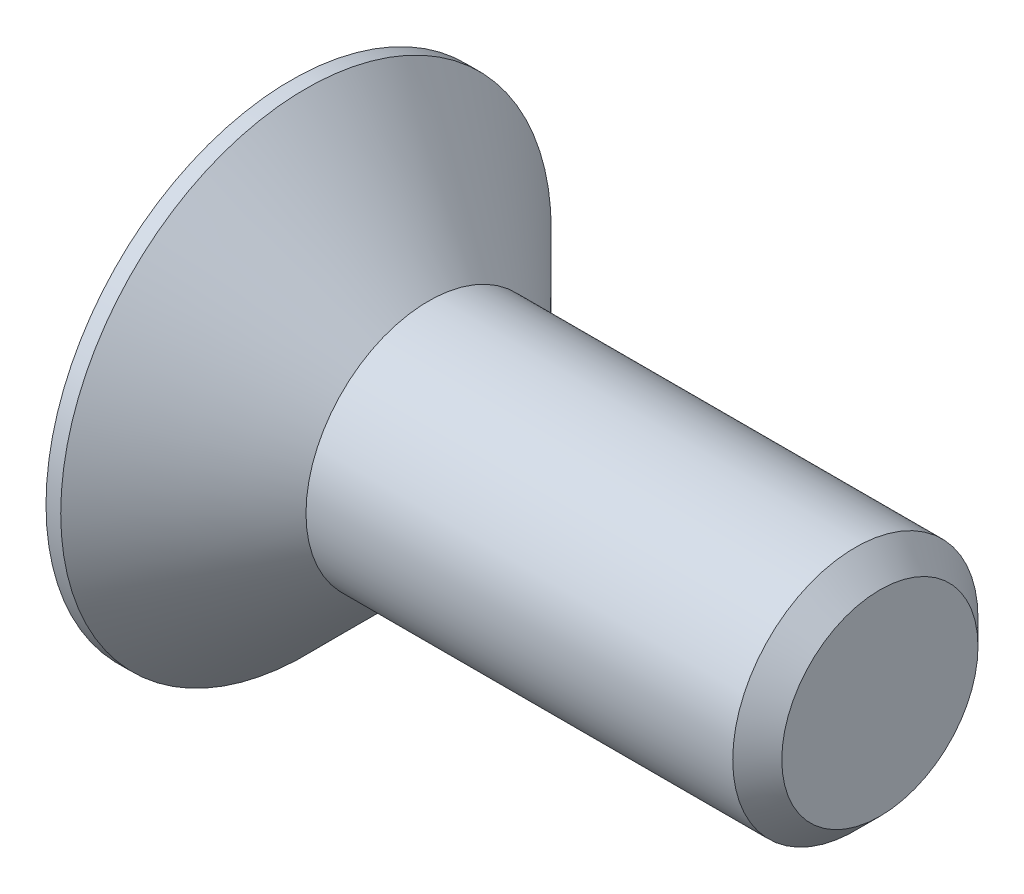
ISO-10303-21;
HEADER;
FILE_DESCRIPTION(('STEP AP214'),'2;1');
FILE_NAME('part.step','',(''),(''),'','','');
FILE_SCHEMA(('AUTOMOTIVE_DESIGN { 1 0 10303 214 1 1 1 1 }'));
ENDSEC;
DATA;
#1=APPLICATION_CONTEXT('core data for automotive mechanical design processes');
#2=APPLICATION_PROTOCOL_DEFINITION('international standard','automotive_design',2000,#1);
#3=PRODUCT_CONTEXT('',#1,'mechanical');
#4=PRODUCT('Part','Part','',(#3));
#5=PRODUCT_RELATED_PRODUCT_CATEGORY('part','',(#4));
#6=PRODUCT_DEFINITION_FORMATION('','',#4);
#7=PRODUCT_DEFINITION_CONTEXT('part definition',#1,'design');
#8=PRODUCT_DEFINITION('design','',#6,#7);
#9=PRODUCT_DEFINITION_SHAPE('','',#8);
#10=(LENGTH_UNIT() NAMED_UNIT(*) SI_UNIT(.MILLI.,.METRE.));
#11=(NAMED_UNIT(*) PLANE_ANGLE_UNIT() SI_UNIT($,.RADIAN.));
#12=(NAMED_UNIT(*) SI_UNIT($,.STERADIAN.) SOLID_ANGLE_UNIT());
#13=UNCERTAINTY_MEASURE_WITH_UNIT(LENGTH_MEASURE(1.E-05),#10,'distance_accuracy_value','');
#14=(GEOMETRIC_REPRESENTATION_CONTEXT(3) GLOBAL_UNCERTAINTY_ASSIGNED_CONTEXT((#13)) GLOBAL_UNIT_ASSIGNED_CONTEXT((#10,
#11,#12)) REPRESENTATION_CONTEXT('',''));
#15=CARTESIAN_POINT('',(0.,0.,0.));
#16=DIRECTION('',(0.,0.,1.));
#17=DIRECTION('',(1.,0.,0.));
#18=AXIS2_PLACEMENT_3D('',#15,#16,#17);
#19=CARTESIAN_POINT('',(0.,0.,0.));
#20=DIRECTION('',(1.,0.,0.));
#21=DIRECTION('',(0.,0.,-1.));
#22=AXIS2_PLACEMENT_3D('',#19,#20,#21);
#23=PLANE('',#22);
#24=DIRECTION('',(0.,0.866025403784439,0.5));
#25=VECTOR('',#24,1.);
#26=CARTESIAN_POINT('',(0.,-0.75,0.433012701892219));
#27=LINE('',#26,#25);
#28=CARTESIAN_POINT('',(0.,-0.75,0.433012701892219));
#29=VERTEX_POINT('',#28);
#30=CARTESIAN_POINT('',(0.,0.,0.866025403784438));
#31=VERTEX_POINT('',#30);
#32=EDGE_CURVE('E122',#29,#31,#27,.T.);
#33=ORIENTED_EDGE('',*,*,#32,.F.);
#34=DIRECTION('',(0.,0.,1.));
#35=VECTOR('',#34,1.);
#36=CARTESIAN_POINT('',(0.,-0.75,-0.43301270189222));
#37=LINE('',#36,#35);
#38=CARTESIAN_POINT('',(0.,-0.75,-0.43301270189222));
#39=VERTEX_POINT('',#38);
#40=EDGE_CURVE('E48',#39,#29,#37,.T.);
#41=ORIENTED_EDGE('',*,*,#40,.F.);
#42=DIRECTION('',(0.,-0.866025403784439,0.5));
#43=VECTOR('',#42,1.);
#44=CARTESIAN_POINT('',(0.,0.,-0.866025403784439));
#45=LINE('',#44,#43);
#46=CARTESIAN_POINT('',(0.,0.,-0.866025403784439));
#47=VERTEX_POINT('',#46);
#48=EDGE_CURVE('E131',#47,#39,#45,.T.);
#49=ORIENTED_EDGE('',*,*,#48,.F.);
#50=DIRECTION('',(0.,-0.866025403784439,-0.5));
#51=VECTOR('',#50,1.);
#52=CARTESIAN_POINT('',(0.,0.75,-0.43301270189222));
#53=LINE('',#52,#51);
#54=CARTESIAN_POINT('',(0.,0.75,-0.43301270189222));
#55=VERTEX_POINT('',#54);
#56=EDGE_CURVE('E129',#55,#47,#53,.T.);
#57=ORIENTED_EDGE('',*,*,#56,.F.);
#58=DIRECTION('',(0.,0.,-1.));
#59=VECTOR('',#58,1.);
#60=CARTESIAN_POINT('',(0.,0.75,0.433012701892219));
#61=LINE('',#60,#59);
#62=CARTESIAN_POINT('',(0.,0.75,0.433012701892219));
#63=VERTEX_POINT('',#62);
#64=EDGE_CURVE('E96',#63,#55,#61,.T.);
#65=ORIENTED_EDGE('',*,*,#64,.F.);
#66=DIRECTION('',(0.,0.866025403784439,-0.5));
#67=VECTOR('',#66,1.);
#68=CARTESIAN_POINT('',(0.,0.,0.866025403784438));
#69=LINE('',#68,#67);
#70=EDGE_CURVE('E125',#31,#63,#69,.T.);
#71=ORIENTED_EDGE('',*,*,#70,.F.);
#72=EDGE_LOOP('',(#33,#41,#49,#57,#65,#71));
#73=FACE_BOUND('',#72,.T.);
#74=CARTESIAN_POINT('',(0.,0.,0.));
#75=DIRECTION('',(-1.,0.,0.));
#76=DIRECTION('',(0.,0.,1.));
#77=AXIS2_PLACEMENT_3D('',#74,#75,#76);
#78=CIRCLE('',#77,2.5);
#79=CARTESIAN_POINT('',(0.,0.,2.5));
#80=VERTEX_POINT('',#79);
#81=EDGE_CURVE('E11',#80,#80,#78,.T.);
#82=ORIENTED_EDGE('',*,*,#81,.T.);
#83=EDGE_LOOP('',(#82));
#84=FACE_BOUND('',#83,.T.);
#85=ADVANCED_FACE('F34',(#73,#84),#23,.F.);
#86=CARTESIAN_POINT('',(-2.28184155946539,0.,0.));
#87=DIRECTION('',(-1.,0.,0.));
#88=DIRECTION('',(0.,0.,1.));
#89=AXIS2_PLACEMENT_3D('',#86,#87,#88);
#90=CYLINDRICAL_SURFACE('',#89,2.5);
#91=ORIENTED_EDGE('',*,*,#81,.F.);
#92=EDGE_LOOP('',(#91));
#93=FACE_BOUND('',#92,.T.);
#94=CARTESIAN_POINT('',(0.15,0.,0.));
#95=DIRECTION('',(-1.,0.,0.));
#96=DIRECTION('',(0.,0.,1.));
#97=AXIS2_PLACEMENT_3D('',#94,#95,#96);
#98=CIRCLE('',#97,2.5);
#99=CARTESIAN_POINT('',(0.15,0.,2.5));
#100=VERTEX_POINT('',#99);
#101=EDGE_CURVE('E41',#100,#100,#98,.T.);
#102=ORIENTED_EDGE('',*,*,#101,.T.);
#103=EDGE_LOOP('',(#102));
#104=FACE_BOUND('',#103,.T.);
#105=ADVANCED_FACE('F151',(#93,#104),#90,.T.);
#106=CARTESIAN_POINT('',(1.4,0.,0.));
#107=DIRECTION('',(-1.,0.,0.));
#108=DIRECTION('',(0.,0.,1.));
#109=AXIS2_PLACEMENT_3D('',#106,#107,#108);
#110=CONICAL_SURFACE('',#109,1.25,0.78539816339745);
#111=ORIENTED_EDGE('',*,*,#101,.F.);
#112=EDGE_LOOP('',(#111));
#113=FACE_BOUND('',#112,.T.);
#114=CARTESIAN_POINT('',(1.4,0.,0.));
#115=DIRECTION('',(-1.,0.,0.));
#116=DIRECTION('',(0.,0.,1.));
#117=AXIS2_PLACEMENT_3D('',#114,#115,#116);
#118=CIRCLE('',#117,1.25);
#119=CARTESIAN_POINT('',(1.4,0.,1.25));
#120=VERTEX_POINT('',#119);
#121=EDGE_CURVE('E146',#120,#120,#118,.T.);
#122=ORIENTED_EDGE('',*,*,#121,.T.);
#123=EDGE_LOOP('',(#122));
#124=FACE_BOUND('',#123,.T.);
#125=ADVANCED_FACE('F153',(#113,#124),#110,.T.);
#126=CARTESIAN_POINT('',(-2.28184155946539,0.,0.));
#127=DIRECTION('',(-1.,0.,0.));
#128=DIRECTION('',(0.,0.,1.));
#129=AXIS2_PLACEMENT_3D('',#126,#127,#128);
#130=CYLINDRICAL_SURFACE('',#129,1.25);
#131=ORIENTED_EDGE('',*,*,#121,.F.);
#132=EDGE_LOOP('',(#131));
#133=FACE_BOUND('',#132,.T.);
#134=CARTESIAN_POINT('',(5.75,0.,0.));
#135=DIRECTION('',(-1.,0.,0.));
#136=DIRECTION('',(0.,0.,1.));
#137=AXIS2_PLACEMENT_3D('',#134,#135,#136);
#138=CIRCLE('',#137,1.25);
#139=CARTESIAN_POINT('',(5.75,0.,1.25));
#140=VERTEX_POINT('',#139);
#141=EDGE_CURVE('E143',#140,#140,#138,.T.);
#142=ORIENTED_EDGE('',*,*,#141,.T.);
#143=EDGE_LOOP('',(#142));
#144=FACE_BOUND('',#143,.T.);
#145=ADVANCED_FACE('F156',(#133,#144),#130,.T.);
#146=CARTESIAN_POINT('',(6.,0.,0.));
#147=DIRECTION('',(-1.,0.,0.));
#148=DIRECTION('',(0.,0.,1.));
#149=AXIS2_PLACEMENT_3D('',#146,#147,#148);
#150=CONICAL_SURFACE('',#149,1.,0.785398163397448);
#151=ORIENTED_EDGE('',*,*,#141,.F.);
#152=EDGE_LOOP('',(#151));
#153=FACE_BOUND('',#152,.T.);
#154=CARTESIAN_POINT('',(6.,0.,0.));
#155=DIRECTION('',(-1.,0.,0.));
#156=DIRECTION('',(0.,0.,1.));
#157=AXIS2_PLACEMENT_3D('',#154,#155,#156);
#158=CIRCLE('',#157,1.);
#159=CARTESIAN_POINT('',(6.,0.,1.));
#160=VERTEX_POINT('',#159);
#161=EDGE_CURVE('E135',#160,#160,#158,.T.);
#162=ORIENTED_EDGE('',*,*,#161,.T.);
#163=EDGE_LOOP('',(#162));
#164=FACE_BOUND('',#163,.T.);
#165=ADVANCED_FACE('F162',(#153,#164),#150,.T.);
#166=CARTESIAN_POINT('',(6.,1.,0.));
#167=DIRECTION('',(-1.,0.,0.));
#168=DIRECTION('',(0.,0.,1.));
#169=AXIS2_PLACEMENT_3D('',#166,#167,#168);
#170=PLANE('',#169);
#171=ORIENTED_EDGE('',*,*,#161,.F.);
#172=EDGE_LOOP('',(#171));
#173=FACE_BOUND('',#172,.T.);
#174=ADVANCED_FACE('F168',(#173),#170,.F.);
#175=CARTESIAN_POINT('',(0.8,-0.75,-0.43301270189222));
#176=DIRECTION('',(0.,-1.,0.));
#177=DIRECTION('',(0.,0.,-1.));
#178=AXIS2_PLACEMENT_3D('',#175,#176,#177);
#179=PLANE('',#178);
#180=ORIENTED_EDGE('',*,*,#40,.T.);
#181=DIRECTION('',(-1.,0.,0.));
#182=VECTOR('',#181,1.);
#183=CARTESIAN_POINT('',(0.8,-0.75,0.433012701892219));
#184=LINE('',#183,#182);
#185=CARTESIAN_POINT('',(0.8,-0.75,0.433012701892219));
#186=VERTEX_POINT('',#185);
#187=EDGE_CURVE('E78',#186,#29,#184,.T.);
#188=ORIENTED_EDGE('',*,*,#187,.F.);
#189=DIRECTION('',(0.,0.,1.));
#190=VECTOR('',#189,1.);
#191=CARTESIAN_POINT('',(0.8,-0.75,-0.43301270189222));
#192=LINE('',#191,#190);
#193=CARTESIAN_POINT('',(0.8,-0.75,-0.43301270189222));
#194=VERTEX_POINT('',#193);
#195=EDGE_CURVE('E133',#194,#186,#192,.T.);
#196=ORIENTED_EDGE('',*,*,#195,.F.);
#197=DIRECTION('',(-1.,0.,0.));
#198=VECTOR('',#197,1.);
#199=CARTESIAN_POINT('',(0.8,-0.75,-0.43301270189222));
#200=LINE('',#199,#198);
#201=EDGE_CURVE('E56',#194,#39,#200,.T.);
#202=ORIENTED_EDGE('',*,*,#201,.T.);
#203=EDGE_LOOP('',(#180,#188,#196,#202));
#204=FACE_BOUND('',#203,.T.);
#205=ADVANCED_FACE('F173',(#204),#179,.F.);
#206=CARTESIAN_POINT('',(0.8,0.,-0.866025403784439));
#207=DIRECTION('',(0.,-0.5,-0.866025403784439));
#208=DIRECTION('',(0.,0.866025403784439,-0.5));
#209=AXIS2_PLACEMENT_3D('',#206,#207,#208);
#210=PLANE('',#209);
#211=ORIENTED_EDGE('',*,*,#48,.T.);
#212=ORIENTED_EDGE('',*,*,#201,.F.);
#213=DIRECTION('',(0.,-0.866025403784439,0.5));
#214=VECTOR('',#213,1.);
#215=CARTESIAN_POINT('',(0.8,0.,-0.866025403784439));
#216=LINE('',#215,#214);
#217=CARTESIAN_POINT('',(0.8,0.,-0.866025403784439));
#218=VERTEX_POINT('',#217);
#219=EDGE_CURVE('E108',#218,#194,#216,.T.);
#220=ORIENTED_EDGE('',*,*,#219,.F.);
#221=DIRECTION('',(-1.,0.,0.));
#222=VECTOR('',#221,1.);
#223=CARTESIAN_POINT('',(0.8,0.,-0.866025403784439));
#224=LINE('',#223,#222);
#225=EDGE_CURVE('E100',#218,#47,#224,.T.);
#226=ORIENTED_EDGE('',*,*,#225,.T.);
#227=EDGE_LOOP('',(#211,#212,#220,#226));
#228=FACE_BOUND('',#227,.T.);
#229=ADVANCED_FACE('F178',(#228),#210,.F.);
#230=CARTESIAN_POINT('',(0.8,0.75,-0.43301270189222));
#231=DIRECTION('',(0.,0.5,-0.866025403784439));
#232=DIRECTION('',(0.,0.866025403784439,0.5));
#233=AXIS2_PLACEMENT_3D('',#230,#231,#232);
#234=PLANE('',#233);
#235=ORIENTED_EDGE('',*,*,#56,.T.);
#236=ORIENTED_EDGE('',*,*,#225,.F.);
#237=DIRECTION('',(0.,-0.866025403784439,-0.5));
#238=VECTOR('',#237,1.);
#239=CARTESIAN_POINT('',(0.8,0.75,-0.43301270189222));
#240=LINE('',#239,#238);
#241=CARTESIAN_POINT('',(0.8,0.75,-0.43301270189222));
#242=VERTEX_POINT('',#241);
#243=EDGE_CURVE('E104',#242,#218,#240,.T.);
#244=ORIENTED_EDGE('',*,*,#243,.F.);
#245=DIRECTION('',(-1.,0.,0.));
#246=VECTOR('',#245,1.);
#247=CARTESIAN_POINT('',(0.8,0.75,-0.43301270189222));
#248=LINE('',#247,#246);
#249=EDGE_CURVE('E89',#242,#55,#248,.T.);
#250=ORIENTED_EDGE('',*,*,#249,.T.);
#251=EDGE_LOOP('',(#235,#236,#244,#250));
#252=FACE_BOUND('',#251,.T.);
#253=ADVANCED_FACE('F105',(#252),#234,.F.);
#254=CARTESIAN_POINT('',(0.8,0.75,0.433012701892219));
#255=DIRECTION('',(0.,1.,0.));
#256=DIRECTION('',(0.,0.,1.));
#257=AXIS2_PLACEMENT_3D('',#254,#255,#256);
#258=PLANE('',#257);
#259=ORIENTED_EDGE('',*,*,#64,.T.);
#260=ORIENTED_EDGE('',*,*,#249,.F.);
#261=DIRECTION('',(0.,0.,-1.));
#262=VECTOR('',#261,1.);
#263=CARTESIAN_POINT('',(0.8,0.75,0.433012701892219));
#264=LINE('',#263,#262);
#265=CARTESIAN_POINT('',(0.8,0.75,0.433012701892219));
#266=VERTEX_POINT('',#265);
#267=EDGE_CURVE('E93',#266,#242,#264,.T.);
#268=ORIENTED_EDGE('',*,*,#267,.F.);
#269=DIRECTION('',(-1.,0.,0.));
#270=VECTOR('',#269,1.);
#271=CARTESIAN_POINT('',(0.8,0.75,0.433012701892219));
#272=LINE('',#271,#270);
#273=EDGE_CURVE('E101',#266,#63,#272,.T.);
#274=ORIENTED_EDGE('',*,*,#273,.T.);
#275=EDGE_LOOP('',(#259,#260,#268,#274));
#276=FACE_BOUND('',#275,.T.);
#277=ADVANCED_FACE('F91',(#276),#258,.F.);
#278=CARTESIAN_POINT('',(0.8,0.,0.866025403784438));
#279=DIRECTION('',(0.,0.5,0.866025403784439));
#280=DIRECTION('',(0.,-0.866025403784439,0.5));
#281=AXIS2_PLACEMENT_3D('',#278,#279,#280);
#282=PLANE('',#281);
#283=ORIENTED_EDGE('',*,*,#70,.T.);
#284=ORIENTED_EDGE('',*,*,#273,.F.);
#285=DIRECTION('',(0.,0.866025403784439,-0.5));
#286=VECTOR('',#285,1.);
#287=CARTESIAN_POINT('',(0.8,0.,0.866025403784438));
#288=LINE('',#287,#286);
#289=CARTESIAN_POINT('',(0.8,0.,0.866025403784438));
#290=VERTEX_POINT('',#289);
#291=EDGE_CURVE('E114',#290,#266,#288,.T.);
#292=ORIENTED_EDGE('',*,*,#291,.F.);
#293=DIRECTION('',(-1.,0.,0.));
#294=VECTOR('',#293,1.);
#295=CARTESIAN_POINT('',(0.8,0.,0.866025403784438));
#296=LINE('',#295,#294);
#297=EDGE_CURVE('E138',#290,#31,#296,.T.);
#298=ORIENTED_EDGE('',*,*,#297,.T.);
#299=EDGE_LOOP('',(#283,#284,#292,#298));
#300=FACE_BOUND('',#299,.T.);
#301=ADVANCED_FACE('F204',(#300),#282,.F.);
#302=CARTESIAN_POINT('',(0.8,-0.75,0.433012701892219));
#303=DIRECTION('',(0.,-0.5,0.866025403784439));
#304=DIRECTION('',(0.,-0.866025403784439,-0.5));
#305=AXIS2_PLACEMENT_3D('',#302,#303,#304);
#306=PLANE('',#305);
#307=ORIENTED_EDGE('',*,*,#32,.T.);
#308=ORIENTED_EDGE('',*,*,#297,.F.);
#309=DIRECTION('',(0.,0.866025403784439,0.5));
#310=VECTOR('',#309,1.);
#311=CARTESIAN_POINT('',(0.8,-0.75,0.433012701892219));
#312=LINE('',#311,#310);
#313=EDGE_CURVE('E116',#186,#290,#312,.T.);
#314=ORIENTED_EDGE('',*,*,#313,.F.);
#315=ORIENTED_EDGE('',*,*,#187,.T.);
#316=EDGE_LOOP('',(#307,#308,#314,#315));
#317=FACE_BOUND('',#316,.T.);
#318=ADVANCED_FACE('F192',(#317),#306,.F.);
#319=CARTESIAN_POINT('',(0.8,0.,0.));
#320=DIRECTION('',(-1.,0.,0.));
#321=DIRECTION('',(0.,0.,1.));
#322=AXIS2_PLACEMENT_3D('',#319,#320,#321);
#323=PLANE('',#322);
#324=ORIENTED_EDGE('',*,*,#195,.T.);
#325=ORIENTED_EDGE('',*,*,#313,.T.);
#326=ORIENTED_EDGE('',*,*,#291,.T.);
#327=ORIENTED_EDGE('',*,*,#267,.T.);
#328=ORIENTED_EDGE('',*,*,#243,.T.);
#329=ORIENTED_EDGE('',*,*,#219,.T.);
#330=EDGE_LOOP('',(#324,#325,#326,#327,#328,#329));
#331=FACE_BOUND('',#330,.T.);
#332=ADVANCED_FACE('F111',(#331),#323,.T.);
#333=CLOSED_SHELL('',(#85,#105,#125,#145,#165,#174,#205,#229,#253,#277,#301,#318,#332));
#334=MANIFOLD_SOLID_BREP('B2',#333);
#335=ADVANCED_BREP_SHAPE_REPRESENTATION('',(#18,#334),#14);
#336=SHAPE_DEFINITION_REPRESENTATION(#9,#335);
ENDSEC;
END-ISO-10303-21;
